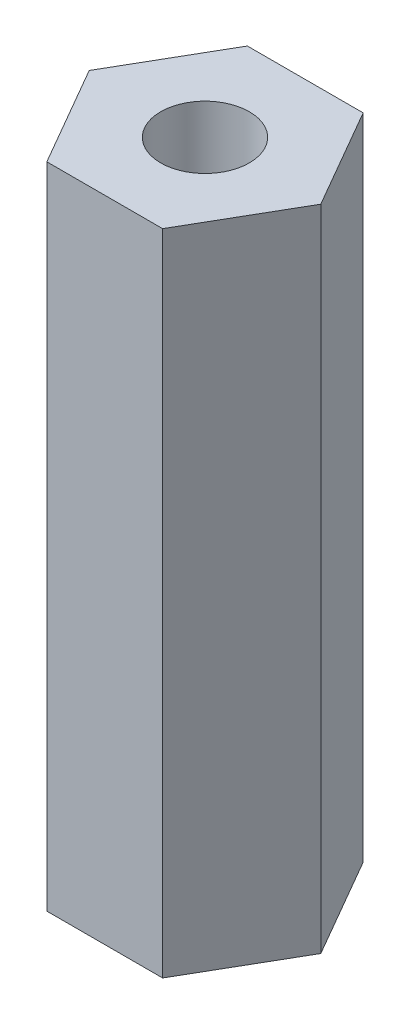
ISO-10303-21;
HEADER;
FILE_DESCRIPTION(('STEP AP214'),'2;1');
FILE_NAME('part.step','',(''),(''),'','','');
FILE_SCHEMA(('AUTOMOTIVE_DESIGN { 1 0 10303 214 1 1 1 1 }'));
ENDSEC;
DATA;
#1=APPLICATION_CONTEXT('core data for automotive mechanical design processes');
#2=APPLICATION_PROTOCOL_DEFINITION('international standard','automotive_design',2000,#1);
#3=PRODUCT_CONTEXT('',#1,'mechanical');
#4=PRODUCT('Part','Part','',(#3));
#5=PRODUCT_RELATED_PRODUCT_CATEGORY('part','',(#4));
#6=PRODUCT_DEFINITION_FORMATION('','',#4);
#7=PRODUCT_DEFINITION_CONTEXT('part definition',#1,'design');
#8=PRODUCT_DEFINITION('design','',#6,#7);
#9=PRODUCT_DEFINITION_SHAPE('','',#8);
#10=(LENGTH_UNIT() NAMED_UNIT(*) SI_UNIT(.MILLI.,.METRE.));
#11=(NAMED_UNIT(*) PLANE_ANGLE_UNIT() SI_UNIT($,.RADIAN.));
#12=(NAMED_UNIT(*) SI_UNIT($,.STERADIAN.) SOLID_ANGLE_UNIT());
#13=UNCERTAINTY_MEASURE_WITH_UNIT(LENGTH_MEASURE(1.E-05),#10,'distance_accuracy_value','');
#14=(GEOMETRIC_REPRESENTATION_CONTEXT(3) GLOBAL_UNCERTAINTY_ASSIGNED_CONTEXT((#13)) GLOBAL_UNIT_ASSIGNED_CONTEXT((#10,
#11,#12)) REPRESENTATION_CONTEXT('',''));
#15=CARTESIAN_POINT('',(0.,0.,0.));
#16=DIRECTION('',(0.,0.,1.));
#17=DIRECTION('',(1.,0.,0.));
#18=AXIS2_PLACEMENT_3D('',#15,#16,#17);
#19=CARTESIAN_POINT('',(-1.33815358641426,15.,2.31775));
#20=DIRECTION('',(0.,0.,-1.));
#21=DIRECTION('',(-1.,0.,0.));
#22=AXIS2_PLACEMENT_3D('',#19,#20,#21);
#23=PLANE('',#22);
#24=DIRECTION('',(1.,0.,0.));
#25=VECTOR('',#24,1.);
#26=CARTESIAN_POINT('',(-1.33815358641426,0.,2.31775));
#27=LINE('',#26,#25);
#28=CARTESIAN_POINT('',(-1.33815358641426,0.,2.31775));
#29=VERTEX_POINT('',#28);
#30=CARTESIAN_POINT('',(1.33815358641425,0.,2.31775));
#31=VERTEX_POINT('',#30);
#32=EDGE_CURVE('E127',#29,#31,#27,.T.);
#33=ORIENTED_EDGE('',*,*,#32,.T.);
#34=DIRECTION('',(0.,-1.,0.));
#35=VECTOR('',#34,1.);
#36=CARTESIAN_POINT('',(1.33815358641425,15.,2.31775));
#37=LINE('',#36,#35);
#38=CARTESIAN_POINT('',(1.33815358641425,15.,2.31775));
#39=VERTEX_POINT('',#38);
#40=EDGE_CURVE('E11',#39,#31,#37,.T.);
#41=ORIENTED_EDGE('',*,*,#40,.F.);
#42=DIRECTION('',(1.,0.,0.));
#43=VECTOR('',#42,1.);
#44=CARTESIAN_POINT('',(-1.33815358641426,15.,2.31775));
#45=LINE('',#44,#43);
#46=CARTESIAN_POINT('',(-1.33815358641426,15.,2.31775));
#47=VERTEX_POINT('',#46);
#48=EDGE_CURVE('E144',#47,#39,#45,.T.);
#49=ORIENTED_EDGE('',*,*,#48,.F.);
#50=DIRECTION('',(0.,-1.,0.));
#51=VECTOR('',#50,1.);
#52=CARTESIAN_POINT('',(-1.33815358641426,15.,2.31775));
#53=LINE('',#52,#51);
#54=EDGE_CURVE('E123',#47,#29,#53,.T.);
#55=ORIENTED_EDGE('',*,*,#54,.T.);
#56=EDGE_LOOP('',(#33,#41,#49,#55));
#57=FACE_BOUND('',#56,.T.);
#58=ADVANCED_FACE('F38',(#57),#23,.F.);
#59=CARTESIAN_POINT('',(1.33815358641425,15.,2.31775));
#60=DIRECTION('',(-0.866025403784439,0.,-0.5));
#61=DIRECTION('',(-0.5,0.,0.866025403784439));
#62=AXIS2_PLACEMENT_3D('',#59,#60,#61);
#63=PLANE('',#62);
#64=DIRECTION('',(0.5,0.,-0.866025403784439));
#65=VECTOR('',#64,1.);
#66=CARTESIAN_POINT('',(1.33815358641425,0.,2.31775));
#67=LINE('',#66,#65);
#68=CARTESIAN_POINT('',(2.67630717282851,0.,0.));
#69=VERTEX_POINT('',#68);
#70=EDGE_CURVE('E131',#31,#69,#67,.T.);
#71=ORIENTED_EDGE('',*,*,#70,.T.);
#72=DIRECTION('',(0.,-1.,0.));
#73=VECTOR('',#72,1.);
#74=CARTESIAN_POINT('',(2.67630717282851,15.,0.));
#75=LINE('',#74,#73);
#76=CARTESIAN_POINT('',(2.67630717282851,15.,0.));
#77=VERTEX_POINT('',#76);
#78=EDGE_CURVE('E47',#77,#69,#75,.T.);
#79=ORIENTED_EDGE('',*,*,#78,.F.);
#80=DIRECTION('',(0.5,0.,-0.866025403784439));
#81=VECTOR('',#80,1.);
#82=CARTESIAN_POINT('',(1.33815358641425,15.,2.31775));
#83=LINE('',#82,#81);
#84=EDGE_CURVE('E92',#39,#77,#83,.T.);
#85=ORIENTED_EDGE('',*,*,#84,.F.);
#86=ORIENTED_EDGE('',*,*,#40,.T.);
#87=EDGE_LOOP('',(#71,#79,#85,#86));
#88=FACE_BOUND('',#87,.T.);
#89=ADVANCED_FACE('F173',(#88),#63,.F.);
#90=CARTESIAN_POINT('',(2.67630717282851,15.,0.));
#91=DIRECTION('',(-0.866025403784439,0.,0.5));
#92=DIRECTION('',(0.5,0.,0.866025403784439));
#93=AXIS2_PLACEMENT_3D('',#90,#91,#92);
#94=PLANE('',#93);
#95=DIRECTION('',(-0.5,0.,-0.866025403784439));
#96=VECTOR('',#95,1.);
#97=CARTESIAN_POINT('',(2.67630717282851,0.,0.));
#98=LINE('',#97,#96);
#99=CARTESIAN_POINT('',(1.33815358641426,0.,-2.31775));
#100=VERTEX_POINT('',#99);
#101=EDGE_CURVE('E135',#69,#100,#98,.T.);
#102=ORIENTED_EDGE('',*,*,#101,.T.);
#103=DIRECTION('',(0.,-1.,0.));
#104=VECTOR('',#103,1.);
#105=CARTESIAN_POINT('',(1.33815358641426,15.,-2.31775));
#106=LINE('',#105,#104);
#107=CARTESIAN_POINT('',(1.33815358641426,15.,-2.31775));
#108=VERTEX_POINT('',#107);
#109=EDGE_CURVE('E116',#108,#100,#106,.T.);
#110=ORIENTED_EDGE('',*,*,#109,.F.);
#111=DIRECTION('',(-0.5,0.,-0.866025403784439));
#112=VECTOR('',#111,1.);
#113=CARTESIAN_POINT('',(2.67630717282851,15.,0.));
#114=LINE('',#113,#112);
#115=EDGE_CURVE('E105',#77,#108,#114,.T.);
#116=ORIENTED_EDGE('',*,*,#115,.F.);
#117=ORIENTED_EDGE('',*,*,#78,.T.);
#118=EDGE_LOOP('',(#102,#110,#116,#117));
#119=FACE_BOUND('',#118,.T.);
#120=ADVANCED_FACE('F154',(#119),#94,.F.);
#121=CARTESIAN_POINT('',(1.33815358641426,15.,-2.31775));
#122=DIRECTION('',(0.,0.,1.));
#123=DIRECTION('',(1.,0.,0.));
#124=AXIS2_PLACEMENT_3D('',#121,#122,#123);
#125=PLANE('',#124);
#126=DIRECTION('',(-1.,0.,0.));
#127=VECTOR('',#126,1.);
#128=CARTESIAN_POINT('',(1.33815358641426,0.,-2.31775));
#129=LINE('',#128,#127);
#130=CARTESIAN_POINT('',(-1.33815358641425,0.,-2.31775));
#131=VERTEX_POINT('',#130);
#132=EDGE_CURVE('E114',#100,#131,#129,.T.);
#133=ORIENTED_EDGE('',*,*,#132,.T.);
#134=DIRECTION('',(0.,-1.,0.));
#135=VECTOR('',#134,1.);
#136=CARTESIAN_POINT('',(-1.33815358641425,15.,-2.31775));
#137=LINE('',#136,#135);
#138=CARTESIAN_POINT('',(-1.33815358641425,15.,-2.31775));
#139=VERTEX_POINT('',#138);
#140=EDGE_CURVE('E111',#139,#131,#137,.T.);
#141=ORIENTED_EDGE('',*,*,#140,.F.);
#142=DIRECTION('',(-1.,0.,0.));
#143=VECTOR('',#142,1.);
#144=CARTESIAN_POINT('',(1.33815358641426,15.,-2.31775));
#145=LINE('',#144,#143);
#146=EDGE_CURVE('E99',#108,#139,#145,.T.);
#147=ORIENTED_EDGE('',*,*,#146,.F.);
#148=ORIENTED_EDGE('',*,*,#109,.T.);
#149=EDGE_LOOP('',(#133,#141,#147,#148));
#150=FACE_BOUND('',#149,.T.);
#151=ADVANCED_FACE('F112',(#150),#125,.F.);
#152=CARTESIAN_POINT('',(-1.33815358641425,15.,-2.31775));
#153=DIRECTION('',(0.866025403784439,0.,0.5));
#154=DIRECTION('',(0.5,0.,-0.866025403784439));
#155=AXIS2_PLACEMENT_3D('',#152,#153,#154);
#156=PLANE('',#155);
#157=DIRECTION('',(-0.5,0.,0.866025403784439));
#158=VECTOR('',#157,1.);
#159=CARTESIAN_POINT('',(-1.33815358641425,0.,-2.31775));
#160=LINE('',#159,#158);
#161=CARTESIAN_POINT('',(-2.67630717282851,0.,0.));
#162=VERTEX_POINT('',#161);
#163=EDGE_CURVE('E78',#131,#162,#160,.T.);
#164=ORIENTED_EDGE('',*,*,#163,.T.);
#165=DIRECTION('',(0.,-1.,0.));
#166=VECTOR('',#165,1.);
#167=CARTESIAN_POINT('',(-2.67630717282851,15.,0.));
#168=LINE('',#167,#166);
#169=CARTESIAN_POINT('',(-2.67630717282851,15.,0.));
#170=VERTEX_POINT('',#169);
#171=EDGE_CURVE('E117',#170,#162,#168,.T.);
#172=ORIENTED_EDGE('',*,*,#171,.F.);
#173=DIRECTION('',(-0.5,0.,0.866025403784439));
#174=VECTOR('',#173,1.);
#175=CARTESIAN_POINT('',(-1.33815358641425,15.,-2.31775));
#176=LINE('',#175,#174);
#177=EDGE_CURVE('E103',#139,#170,#176,.T.);
#178=ORIENTED_EDGE('',*,*,#177,.F.);
#179=ORIENTED_EDGE('',*,*,#140,.T.);
#180=EDGE_LOOP('',(#164,#172,#178,#179));
#181=FACE_BOUND('',#180,.T.);
#182=ADVANCED_FACE('F119',(#181),#156,.F.);
#183=CARTESIAN_POINT('',(-2.67630717282851,15.,0.));
#184=DIRECTION('',(0.866025403784439,0.,-0.5));
#185=DIRECTION('',(-0.5,0.,-0.866025403784439));
#186=AXIS2_PLACEMENT_3D('',#183,#184,#185);
#187=PLANE('',#186);
#188=DIRECTION('',(0.5,0.,0.866025403784439));
#189=VECTOR('',#188,1.);
#190=CARTESIAN_POINT('',(-2.67630717282851,0.,0.));
#191=LINE('',#190,#189);
#192=EDGE_CURVE('E84',#162,#29,#191,.T.);
#193=ORIENTED_EDGE('',*,*,#192,.T.);
#194=ORIENTED_EDGE('',*,*,#54,.F.);
#195=DIRECTION('',(0.5,0.,0.866025403784439));
#196=VECTOR('',#195,1.);
#197=CARTESIAN_POINT('',(-2.67630717282851,15.,0.));
#198=LINE('',#197,#196);
#199=EDGE_CURVE('E55',#170,#47,#198,.T.);
#200=ORIENTED_EDGE('',*,*,#199,.F.);
#201=ORIENTED_EDGE('',*,*,#171,.T.);
#202=EDGE_LOOP('',(#193,#194,#200,#201));
#203=FACE_BOUND('',#202,.T.);
#204=ADVANCED_FACE('F161',(#203),#187,.F.);
#205=CARTESIAN_POINT('',(0.,15.,0.));
#206=DIRECTION('',(0.,1.,0.));
#207=DIRECTION('',(0.,0.,1.));
#208=AXIS2_PLACEMENT_3D('',#205,#206,#207);
#209=PLANE('',#208);
#210=CARTESIAN_POINT('',(0.,15.,0.));
#211=DIRECTION('',(0.,1.,0.));
#212=DIRECTION('',(0.,0.,1.));
#213=AXIS2_PLACEMENT_3D('',#210,#211,#212);
#214=CIRCLE('',#213,1.02499999999999);
#215=CARTESIAN_POINT('',(0.,15.,1.02499999999999));
#216=VERTEX_POINT('',#215);
#217=EDGE_CURVE('E132',#216,#216,#214,.T.);
#218=ORIENTED_EDGE('',*,*,#217,.F.);
#219=EDGE_LOOP('',(#218));
#220=FACE_BOUND('',#219,.T.);
#221=ORIENTED_EDGE('',*,*,#48,.T.);
#222=ORIENTED_EDGE('',*,*,#84,.T.);
#223=ORIENTED_EDGE('',*,*,#115,.T.);
#224=ORIENTED_EDGE('',*,*,#146,.T.);
#225=ORIENTED_EDGE('',*,*,#177,.T.);
#226=ORIENTED_EDGE('',*,*,#199,.T.);
#227=EDGE_LOOP('',(#221,#222,#223,#224,#225,#226));
#228=FACE_BOUND('',#227,.T.);
#229=ADVANCED_FACE('F101',(#220,#228),#209,.T.);
#230=CARTESIAN_POINT('',(0.,0.,0.));
#231=DIRECTION('',(0.,1.,0.));
#232=DIRECTION('',(0.,0.,1.));
#233=AXIS2_PLACEMENT_3D('',#230,#231,#232);
#234=PLANE('',#233);
#235=CARTESIAN_POINT('',(0.,0.,0.));
#236=DIRECTION('',(0.,-1.,0.));
#237=DIRECTION('',(0.,0.,-1.));
#238=AXIS2_PLACEMENT_3D('',#235,#236,#237);
#239=CIRCLE('',#238,1.025);
#240=CARTESIAN_POINT('',(0.,0.,-1.025));
#241=VERTEX_POINT('',#240);
#242=EDGE_CURVE('E228',#241,#241,#239,.T.);
#243=ORIENTED_EDGE('',*,*,#242,.F.);
#244=EDGE_LOOP('',(#243));
#245=FACE_BOUND('',#244,.T.);
#246=ORIENTED_EDGE('',*,*,#32,.F.);
#247=ORIENTED_EDGE('',*,*,#192,.F.);
#248=ORIENTED_EDGE('',*,*,#163,.F.);
#249=ORIENTED_EDGE('',*,*,#132,.F.);
#250=ORIENTED_EDGE('',*,*,#101,.F.);
#251=ORIENTED_EDGE('',*,*,#70,.F.);
#252=EDGE_LOOP('',(#246,#247,#248,#249,#250,#251));
#253=FACE_BOUND('',#252,.T.);
#254=ADVANCED_FACE('F157',(#245,#253),#234,.F.);
#255=CARTESIAN_POINT('',(0.,0.,0.));
#256=DIRECTION('',(0.,-1.,0.));
#257=DIRECTION('',(0.,0.,-1.));
#258=AXIS2_PLACEMENT_3D('',#255,#256,#257);
#259=CYLINDRICAL_SURFACE('',#258,1.02499999999999);
#260=ORIENTED_EDGE('',*,*,#217,.T.);
#261=EDGE_LOOP('',(#260));
#262=FACE_BOUND('',#261,.T.);
#263=ORIENTED_EDGE('',*,*,#242,.T.);
#264=EDGE_LOOP('',(#263));
#265=FACE_BOUND('',#264,.T.);
#266=ADVANCED_FACE('F210',(#262,#265),#259,.F.);
#267=CLOSED_SHELL('',(#58,#89,#120,#151,#182,#204,#229,#254,#266));
#268=MANIFOLD_SOLID_BREP('B2',#267);
#269=ADVANCED_BREP_SHAPE_REPRESENTATION('',(#18,#268),#14);
#270=SHAPE_DEFINITION_REPRESENTATION(#9,#269);
ENDSEC;
END-ISO-10303-21;
